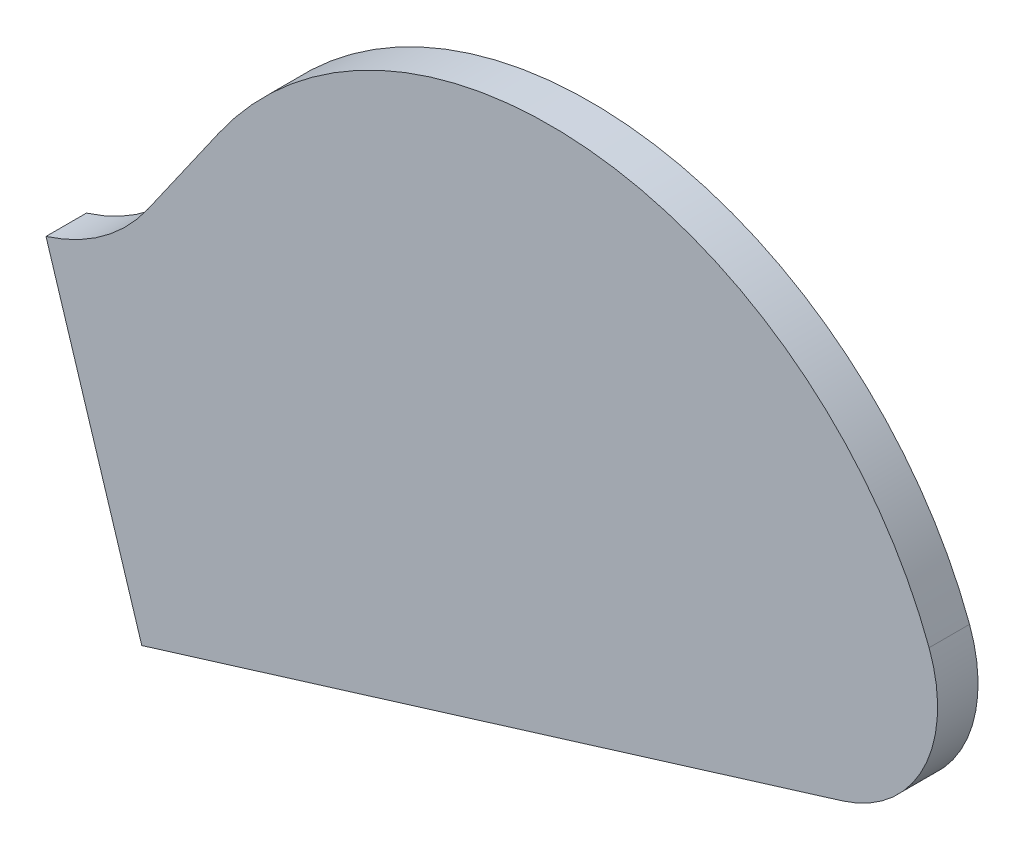
ISO-10303-21;
HEADER;
FILE_DESCRIPTION(('STEP AP214'),'2;1');
FILE_NAME('part.step','',(''),(''),'','','');
FILE_SCHEMA(('AUTOMOTIVE_DESIGN { 1 0 10303 214 1 1 1 1 }'));
ENDSEC;
DATA;
#1=APPLICATION_CONTEXT('core data for automotive mechanical design processes');
#2=APPLICATION_PROTOCOL_DEFINITION('international standard','automotive_design',2000,#1);
#3=PRODUCT_CONTEXT('',#1,'mechanical');
#4=PRODUCT('Part','Part','',(#3));
#5=PRODUCT_RELATED_PRODUCT_CATEGORY('part','',(#4));
#6=PRODUCT_DEFINITION_FORMATION('','',#4);
#7=PRODUCT_DEFINITION_CONTEXT('part definition',#1,'design');
#8=PRODUCT_DEFINITION('design','',#6,#7);
#9=PRODUCT_DEFINITION_SHAPE('','',#8);
#10=(LENGTH_UNIT() NAMED_UNIT(*) SI_UNIT(.MILLI.,.METRE.));
#11=(NAMED_UNIT(*) PLANE_ANGLE_UNIT() SI_UNIT($,.RADIAN.));
#12=(NAMED_UNIT(*) SI_UNIT($,.STERADIAN.) SOLID_ANGLE_UNIT());
#13=UNCERTAINTY_MEASURE_WITH_UNIT(LENGTH_MEASURE(1.E-05),#10,'distance_accuracy_value','');
#14=(GEOMETRIC_REPRESENTATION_CONTEXT(3) GLOBAL_UNCERTAINTY_ASSIGNED_CONTEXT((#13)) GLOBAL_UNIT_ASSIGNED_CONTEXT((#10,
#11,#12)) REPRESENTATION_CONTEXT('',''));
#15=CARTESIAN_POINT('',(0.,0.,0.));
#16=DIRECTION('',(0.,0.,1.));
#17=DIRECTION('',(1.,0.,0.));
#18=AXIS2_PLACEMENT_3D('',#15,#16,#17);
#19=CARTESIAN_POINT('',(-30.1241306273274,-77.2652138906787,3.));
#20=DIRECTION('',(0.,0.,1.));
#21=DIRECTION('',(1.,0.,0.));
#22=AXIS2_PLACEMENT_3D('',#19,#20,#21);
#23=PLANE('',#22);
#24=DIRECTION('',(-0.298362313488952,0.954452686040288,0.));
#25=VECTOR('',#24,1.);
#26=CARTESIAN_POINT('',(19.3213722455699,-61.8085287720205,3.));
#27=LINE('',#26,#25);
#28=CARTESIAN_POINT('',(11.4310193454737,-36.5675107921091,3.));
#29=VERTEX_POINT('',#28);
#30=CARTESIAN_POINT('',(4.32625354558977,-13.8395639475842,3.));
#31=VERTEX_POINT('',#30);
#32=EDGE_CURVE('E90',#29,#31,#27,.T.);
#33=ORIENTED_EDGE('',*,*,#32,.F.);
#34=DIRECTION('',(-0.955703991120572,-0.294329545503353,0.));
#35=VECTOR('',#34,1.);
#36=CARTESIAN_POINT('',(11.276413219095,-36.6151250652855,3.));
#37=LINE('',#36,#35);
#38=CARTESIAN_POINT('',(63.4009688004772,-20.562250015717,3.));
#39=VERTEX_POINT('',#38);
#40=EDGE_CURVE('E102',#39,#29,#37,.T.);
#41=ORIENTED_EDGE('',*,*,#40,.F.);
#42=CARTESIAN_POINT('',(60.4576733454437,-11.0052101045113,3.));
#43=DIRECTION('',(0.,0.,1.));
#44=DIRECTION('',(1.,0.,0.));
#45=AXIS2_PLACEMENT_3D('',#42,#43,#44);
#46=CIRCLE('',#45,10.);
#47=CARTESIAN_POINT('',(69.8261432621106,-7.50781515676704,3.));
#48=VERTEX_POINT('',#47);
#49=EDGE_CURVE('E58',#39,#48,#46,.T.);
#50=ORIENTED_EDGE('',*,*,#49,.T.);
#51=CARTESIAN_POINT('',(41.72073351211,-17.9999999999998,3.));
#52=DIRECTION('',(0.,0.,-1.));
#53=DIRECTION('',(-1.,0.,0.));
#54=AXIS2_PLACEMENT_3D('',#51,#52,#53);
#55=CIRCLE('',#54,29.9999999999999);
#56=CARTESIAN_POINT('',(17.1461721834403,-0.792706909468565,3.));
#57=VERTEX_POINT('',#56);
#58=EDGE_CURVE('E120',#48,#57,#55,.F.);
#59=ORIENTED_EDGE('',*,*,#58,.T.);
#60=DIRECTION('',(-0.573576436351046,-0.819152044288992,0.));
#61=VECTOR('',#60,1.);
#62=CARTESIAN_POINT('',(17.1461721834403,-0.792706909468616,3.));
#63=LINE('',#62,#61);
#64=CARTESIAN_POINT('',(11.8777046421904,-8.31685832709021,3.));
#65=VERTEX_POINT('',#64);
#66=EDGE_CURVE('E129',#57,#65,#63,.T.);
#67=ORIENTED_EDGE('',*,*,#66,.T.);
#68=CARTESIAN_POINT('',(0.,0.,3.));
#69=DIRECTION('',(0.,0.,1.));
#70=DIRECTION('',(1.,0.,0.));
#71=AXIS2_PLACEMENT_3D('',#68,#69,#70);
#72=CIRCLE('',#71,14.4999999999999);
#73=EDGE_CURVE('E105',#65,#31,#72,.F.);
#74=ORIENTED_EDGE('',*,*,#73,.T.);
#75=EDGE_LOOP('',(#33,#41,#50,#59,#67,#74));
#76=FACE_BOUND('',#75,.T.);
#77=ADVANCED_FACE('F36',(#76),#23,.T.);
#78=CARTESIAN_POINT('',(55.01,-77.2652138906787,0.));
#79=DIRECTION('',(0.,0.,-1.));
#80=DIRECTION('',(-1.,0.,0.));
#81=AXIS2_PLACEMENT_3D('',#78,#79,#80);
#82=PLANE('',#81);
#83=DIRECTION('',(0.298362313488952,-0.954452686040288,0.));
#84=VECTOR('',#83,1.);
#85=CARTESIAN_POINT('',(26.9000185228093,-86.0524059938944,0.));
#86=LINE('',#85,#84);
#87=CARTESIAN_POINT('',(4.32625354558977,-13.8395639475842,0.));
#88=VERTEX_POINT('',#87);
#89=CARTESIAN_POINT('',(11.4310193454737,-36.5675107921091,0.));
#90=VERTEX_POINT('',#89);
#91=EDGE_CURVE('E93',#88,#90,#86,.T.);
#92=ORIENTED_EDGE('',*,*,#91,.F.);
#93=CARTESIAN_POINT('',(0.,0.,0.));
#94=DIRECTION('',(0.,0.,1.));
#95=DIRECTION('',(1.,0.,0.));
#96=AXIS2_PLACEMENT_3D('',#93,#94,#95);
#97=CIRCLE('',#96,14.4999999999999);
#98=CARTESIAN_POINT('',(11.8777046421904,-8.31685832709022,0.));
#99=VERTEX_POINT('',#98);
#100=EDGE_CURVE('E126',#88,#99,#97,.T.);
#101=ORIENTED_EDGE('',*,*,#100,.T.);
#102=DIRECTION('',(0.573576436351047,0.819152044288991,0.));
#103=VECTOR('',#102,1.);
#104=CARTESIAN_POINT('',(11.8777046421904,-8.31685832709017,0.));
#105=LINE('',#104,#103);
#106=CARTESIAN_POINT('',(17.1461721834403,-0.792706909468564,0.));
#107=VERTEX_POINT('',#106);
#108=EDGE_CURVE('E123',#99,#107,#105,.T.);
#109=ORIENTED_EDGE('',*,*,#108,.T.);
#110=CARTESIAN_POINT('',(41.72073351211,-17.9999999999998,0.));
#111=DIRECTION('',(0.,0.,-1.));
#112=DIRECTION('',(-1.,0.,0.));
#113=AXIS2_PLACEMENT_3D('',#110,#111,#112);
#114=CIRCLE('',#113,29.9999999999999);
#115=CARTESIAN_POINT('',(69.8261432621106,-7.50781515676704,0.));
#116=VERTEX_POINT('',#115);
#117=EDGE_CURVE('E99',#107,#116,#114,.T.);
#118=ORIENTED_EDGE('',*,*,#117,.T.);
#119=CARTESIAN_POINT('',(60.4576733454437,-11.0052101045113,0.));
#120=DIRECTION('',(0.,0.,-1.));
#121=DIRECTION('',(-1.,0.,0.));
#122=AXIS2_PLACEMENT_3D('',#119,#120,#121);
#123=CIRCLE('',#122,10.);
#124=CARTESIAN_POINT('',(63.4009688004772,-20.562250015717,0.));
#125=VERTEX_POINT('',#124);
#126=EDGE_CURVE('E11',#116,#125,#123,.T.);
#127=ORIENTED_EDGE('',*,*,#126,.T.);
#128=DIRECTION('',(-0.955703991120572,-0.294329545503353,0.));
#129=VECTOR('',#128,1.);
#130=CARTESIAN_POINT('',(11.276413219095,-36.6151250652855,0.));
#131=LINE('',#130,#129);
#132=EDGE_CURVE('E111',#125,#90,#131,.T.);
#133=ORIENTED_EDGE('',*,*,#132,.T.);
#134=EDGE_LOOP('',(#92,#101,#109,#118,#127,#133));
#135=FACE_BOUND('',#134,.T.);
#136=ADVANCED_FACE('F143',(#135),#82,.T.);
#137=CARTESIAN_POINT('',(0.,0.,0.));
#138=DIRECTION('',(0.,0.,1.));
#139=DIRECTION('',(1.,0.,0.));
#140=AXIS2_PLACEMENT_3D('',#137,#138,#139);
#141=CYLINDRICAL_SURFACE('',#140,14.4999999999999);
#142=DIRECTION('',(0.,0.,1.));
#143=VECTOR('',#142,1.);
#144=CARTESIAN_POINT('',(4.32625354558977,-13.8395639475842,0.));
#145=LINE('',#144,#143);
#146=EDGE_CURVE('E106',#31,#88,#145,.F.);
#147=ORIENTED_EDGE('',*,*,#146,.F.);
#148=ORIENTED_EDGE('',*,*,#73,.F.);
#149=DIRECTION('',(0.,0.,1.));
#150=VECTOR('',#149,1.);
#151=CARTESIAN_POINT('',(11.8777046421904,-8.31685832709017,1.5));
#152=LINE('',#151,#150);
#153=EDGE_CURVE('E113',#99,#65,#152,.T.);
#154=ORIENTED_EDGE('',*,*,#153,.F.);
#155=ORIENTED_EDGE('',*,*,#100,.F.);
#156=EDGE_LOOP('',(#147,#148,#154,#155));
#157=FACE_BOUND('',#156,.T.);
#158=ADVANCED_FACE('F141',(#157),#141,.F.);
#159=CARTESIAN_POINT('',(17.1519079478038,-0.784515389025722,-0.01));
#160=DIRECTION('',(-0.819152044288992,0.573576436351045,0.));
#161=DIRECTION('',(-0.573576436351045,-0.819152044288992,0.));
#162=AXIS2_PLACEMENT_3D('',#159,#160,#161);
#163=PLANE('',#162);
#164=ORIENTED_EDGE('',*,*,#153,.T.);
#165=ORIENTED_EDGE('',*,*,#66,.F.);
#166=DIRECTION('',(0.,0.,1.));
#167=VECTOR('',#166,1.);
#168=CARTESIAN_POINT('',(17.1461721834403,-0.792706909468617,1.5));
#169=LINE('',#168,#167);
#170=EDGE_CURVE('E117',#107,#57,#169,.T.);
#171=ORIENTED_EDGE('',*,*,#170,.F.);
#172=ORIENTED_EDGE('',*,*,#108,.F.);
#173=EDGE_LOOP('',(#164,#165,#171,#172));
#174=FACE_BOUND('',#173,.T.);
#175=ADVANCED_FACE('F137',(#174),#163,.T.);
#176=CARTESIAN_POINT('',(41.72073351211,-17.9999999999998,3.));
#177=DIRECTION('',(0.,0.,-1.));
#178=DIRECTION('',(-1.,0.,0.));
#179=AXIS2_PLACEMENT_3D('',#176,#177,#178);
#180=CYLINDRICAL_SURFACE('',#179,29.9999999999999);
#181=ORIENTED_EDGE('',*,*,#58,.F.);
#182=DIRECTION('',(0.,0.,-1.));
#183=VECTOR('',#182,1.);
#184=CARTESIAN_POINT('',(69.8261432621106,-7.50781515676704,3.));
#185=LINE('',#184,#183);
#186=EDGE_CURVE('E44',#48,#116,#185,.T.);
#187=ORIENTED_EDGE('',*,*,#186,.T.);
#188=ORIENTED_EDGE('',*,*,#117,.F.);
#189=ORIENTED_EDGE('',*,*,#170,.T.);
#190=EDGE_LOOP('',(#181,#187,#188,#189));
#191=FACE_BOUND('',#190,.T.);
#192=ADVANCED_FACE('F134',(#191),#180,.T.);
#193=CARTESIAN_POINT('',(11.276413219095,-36.6151250652855,0.));
#194=DIRECTION('',(-0.294329545503353,0.955703991120572,0.));
#195=DIRECTION('',(-0.955703991120572,-0.294329545503353,0.));
#196=AXIS2_PLACEMENT_3D('',#193,#194,#195);
#197=PLANE('',#196);
#198=ORIENTED_EDGE('',*,*,#132,.F.);
#199=DIRECTION('',(0.,0.,1.));
#200=VECTOR('',#199,1.);
#201=CARTESIAN_POINT('',(63.4009688004772,-20.562250015717,3.));
#202=LINE('',#201,#200);
#203=EDGE_CURVE('E98',#125,#39,#202,.T.);
#204=ORIENTED_EDGE('',*,*,#203,.T.);
#205=ORIENTED_EDGE('',*,*,#40,.T.);
#206=DIRECTION('',(0.,0.,1.));
#207=VECTOR('',#206,1.);
#208=CARTESIAN_POINT('',(11.4310193454737,-36.5675107921091,0.));
#209=LINE('',#208,#207);
#210=EDGE_CURVE('E87',#29,#90,#209,.F.);
#211=ORIENTED_EDGE('',*,*,#210,.T.);
#212=EDGE_LOOP('',(#198,#204,#205,#211));
#213=FACE_BOUND('',#212,.T.);
#214=ADVANCED_FACE('F109',(#213),#197,.F.);
#215=CARTESIAN_POINT('',(60.4576733454437,-11.0052101045113,3.));
#216=DIRECTION('',(0.,0.,-1.));
#217=DIRECTION('',(-1.,0.,0.));
#218=AXIS2_PLACEMENT_3D('',#215,#216,#217);
#219=CYLINDRICAL_SURFACE('',#218,10.);
#220=ORIENTED_EDGE('',*,*,#126,.F.);
#221=ORIENTED_EDGE('',*,*,#186,.F.);
#222=ORIENTED_EDGE('',*,*,#49,.F.);
#223=ORIENTED_EDGE('',*,*,#203,.F.);
#224=EDGE_LOOP('',(#220,#221,#222,#223));
#225=FACE_BOUND('',#224,.T.);
#226=ADVANCED_FACE('F38',(#225),#219,.T.);
#227=CARTESIAN_POINT('',(-15.3630876801536,49.1460872880582,174.006802745557));
#228=DIRECTION('',(0.954452686040288,0.298362313488952,0.));
#229=DIRECTION('',(-0.298362313488952,0.954452686040288,0.));
#230=AXIS2_PLACEMENT_3D('',#227,#228,#229);
#231=PLANE('',#230);
#232=ORIENTED_EDGE('',*,*,#32,.T.);
#233=ORIENTED_EDGE('',*,*,#146,.T.);
#234=ORIENTED_EDGE('',*,*,#91,.T.);
#235=ORIENTED_EDGE('',*,*,#210,.F.);
#236=EDGE_LOOP('',(#232,#233,#234,#235));
#237=FACE_BOUND('',#236,.T.);
#238=ADVANCED_FACE('F89',(#237),#231,.F.);
#239=CLOSED_SHELL('',(#77,#136,#158,#175,#192,#214,#226,#238));
#240=MANIFOLD_SOLID_BREP('B2',#239);
#241=ADVANCED_BREP_SHAPE_REPRESENTATION('',(#18,#240),#14);
#242=SHAPE_DEFINITION_REPRESENTATION(#9,#241);
ENDSEC;
END-ISO-10303-21;
